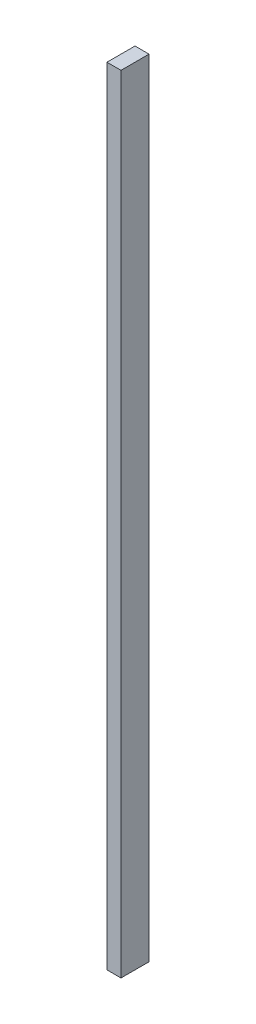
ISO-10303-21;
HEADER;
FILE_DESCRIPTION(('STEP AP214'),'2;1');
FILE_NAME('part.step','',(''),(''),'','','');
FILE_SCHEMA(('AUTOMOTIVE_DESIGN { 1 0 10303 214 1 1 1 1 }'));
ENDSEC;
DATA;
#1=APPLICATION_CONTEXT('core data for automotive mechanical design processes');
#2=APPLICATION_PROTOCOL_DEFINITION('international standard','automotive_design',2000,#1);
#3=PRODUCT_CONTEXT('',#1,'mechanical');
#4=PRODUCT('Part','Part','',(#3));
#5=PRODUCT_RELATED_PRODUCT_CATEGORY('part','',(#4));
#6=PRODUCT_DEFINITION_FORMATION('','',#4);
#7=PRODUCT_DEFINITION_CONTEXT('part definition',#1,'design');
#8=PRODUCT_DEFINITION('design','',#6,#7);
#9=PRODUCT_DEFINITION_SHAPE('','',#8);
#10=(LENGTH_UNIT() NAMED_UNIT(*) SI_UNIT(.MILLI.,.METRE.));
#11=(NAMED_UNIT(*) PLANE_ANGLE_UNIT() SI_UNIT($,.RADIAN.));
#12=(NAMED_UNIT(*) SI_UNIT($,.STERADIAN.) SOLID_ANGLE_UNIT());
#13=UNCERTAINTY_MEASURE_WITH_UNIT(LENGTH_MEASURE(1.E-05),#10,'distance_accuracy_value','');
#14=(GEOMETRIC_REPRESENTATION_CONTEXT(3) GLOBAL_UNCERTAINTY_ASSIGNED_CONTEXT((#13)) GLOBAL_UNIT_ASSIGNED_CONTEXT((#10,
#11,#12)) REPRESENTATION_CONTEXT('',''));
#15=CARTESIAN_POINT('',(0.,0.,0.));
#16=DIRECTION('',(0.,0.,1.));
#17=DIRECTION('',(1.,0.,0.));
#18=AXIS2_PLACEMENT_3D('',#15,#16,#17);
#19=CARTESIAN_POINT('',(0.,56.,-2.));
#20=DIRECTION('',(-1.,0.,0.));
#21=DIRECTION('',(0.,0.,1.));
#22=AXIS2_PLACEMENT_3D('',#19,#20,#21);
#23=PLANE('',#22);
#24=DIRECTION('',(0.,0.,-1.));
#25=VECTOR('',#24,1.);
#26=CARTESIAN_POINT('',(0.,0.,-2.));
#27=LINE('',#26,#25);
#28=CARTESIAN_POINT('',(0.,0.,0.));
#29=VERTEX_POINT('',#28);
#30=CARTESIAN_POINT('',(0.,0.,-2.));
#31=VERTEX_POINT('',#30);
#32=EDGE_CURVE('E97',#29,#31,#27,.T.);
#33=ORIENTED_EDGE('',*,*,#32,.F.);
#34=DIRECTION('',(0.,-1.,0.));
#35=VECTOR('',#34,1.);
#36=CARTESIAN_POINT('',(0.,56.,0.));
#37=LINE('',#36,#35);
#38=CARTESIAN_POINT('',(0.,56.,0.));
#39=VERTEX_POINT('',#38);
#40=EDGE_CURVE('E11',#39,#29,#37,.T.);
#41=ORIENTED_EDGE('',*,*,#40,.F.);
#42=DIRECTION('',(0.,0.,-1.));
#43=VECTOR('',#42,1.);
#44=CARTESIAN_POINT('',(0.,56.,-2.));
#45=LINE('',#44,#43);
#46=CARTESIAN_POINT('',(0.,56.,-2.));
#47=VERTEX_POINT('',#46);
#48=EDGE_CURVE('E91',#39,#47,#45,.T.);
#49=ORIENTED_EDGE('',*,*,#48,.T.);
#50=DIRECTION('',(0.,-1.,0.));
#51=VECTOR('',#50,1.);
#52=CARTESIAN_POINT('',(0.,56.,-2.));
#53=LINE('',#52,#51);
#54=EDGE_CURVE('E36',#47,#31,#53,.T.);
#55=ORIENTED_EDGE('',*,*,#54,.T.);
#56=EDGE_LOOP('',(#33,#41,#49,#55));
#57=FACE_BOUND('',#56,.T.);
#58=ADVANCED_FACE('F33',(#57),#23,.T.);
#59=CARTESIAN_POINT('',(0.,56.,0.));
#60=DIRECTION('',(0.,0.,1.));
#61=DIRECTION('',(1.,0.,0.));
#62=AXIS2_PLACEMENT_3D('',#59,#60,#61);
#63=PLANE('',#62);
#64=DIRECTION('',(-1.,0.,0.));
#65=VECTOR('',#64,1.);
#66=CARTESIAN_POINT('',(0.,0.,0.));
#67=LINE('',#66,#65);
#68=CARTESIAN_POINT('',(1.,0.,0.));
#69=VERTEX_POINT('',#68);
#70=EDGE_CURVE('E93',#69,#29,#67,.T.);
#71=ORIENTED_EDGE('',*,*,#70,.F.);
#72=DIRECTION('',(0.,-1.,0.));
#73=VECTOR('',#72,1.);
#74=CARTESIAN_POINT('',(1.,56.,0.));
#75=LINE('',#74,#73);
#76=CARTESIAN_POINT('',(1.,56.,0.));
#77=VERTEX_POINT('',#76);
#78=EDGE_CURVE('E42',#77,#69,#75,.T.);
#79=ORIENTED_EDGE('',*,*,#78,.F.);
#80=DIRECTION('',(-1.,0.,0.));
#81=VECTOR('',#80,1.);
#82=CARTESIAN_POINT('',(0.,56.,0.));
#83=LINE('',#82,#81);
#84=EDGE_CURVE('E88',#77,#39,#83,.T.);
#85=ORIENTED_EDGE('',*,*,#84,.T.);
#86=ORIENTED_EDGE('',*,*,#40,.T.);
#87=EDGE_LOOP('',(#71,#79,#85,#86));
#88=FACE_BOUND('',#87,.T.);
#89=ADVANCED_FACE('F107',(#88),#63,.T.);
#90=CARTESIAN_POINT('',(1.,56.,-2.));
#91=DIRECTION('',(1.,0.,0.));
#92=DIRECTION('',(0.,0.,-1.));
#93=AXIS2_PLACEMENT_3D('',#90,#91,#92);
#94=PLANE('',#93);
#95=DIRECTION('',(0.,0.,1.));
#96=VECTOR('',#95,1.);
#97=CARTESIAN_POINT('',(1.,0.,-2.));
#98=LINE('',#97,#96);
#99=CARTESIAN_POINT('',(1.,0.,-2.));
#100=VERTEX_POINT('',#99);
#101=EDGE_CURVE('E83',#100,#69,#98,.T.);
#102=ORIENTED_EDGE('',*,*,#101,.F.);
#103=DIRECTION('',(0.,-1.,0.));
#104=VECTOR('',#103,1.);
#105=CARTESIAN_POINT('',(1.,56.,-2.));
#106=LINE('',#105,#104);
#107=CARTESIAN_POINT('',(1.,56.,-2.));
#108=VERTEX_POINT('',#107);
#109=EDGE_CURVE('E78',#108,#100,#106,.T.);
#110=ORIENTED_EDGE('',*,*,#109,.F.);
#111=DIRECTION('',(0.,0.,1.));
#112=VECTOR('',#111,1.);
#113=CARTESIAN_POINT('',(1.,56.,-2.));
#114=LINE('',#113,#112);
#115=EDGE_CURVE('E81',#108,#77,#114,.T.);
#116=ORIENTED_EDGE('',*,*,#115,.T.);
#117=ORIENTED_EDGE('',*,*,#78,.T.);
#118=EDGE_LOOP('',(#102,#110,#116,#117));
#119=FACE_BOUND('',#118,.T.);
#120=ADVANCED_FACE('F80',(#119),#94,.T.);
#121=CARTESIAN_POINT('',(0.,56.,-2.));
#122=DIRECTION('',(0.,0.,-1.));
#123=DIRECTION('',(-1.,0.,0.));
#124=AXIS2_PLACEMENT_3D('',#121,#122,#123);
#125=PLANE('',#124);
#126=DIRECTION('',(1.,0.,0.));
#127=VECTOR('',#126,1.);
#128=CARTESIAN_POINT('',(0.,0.,-2.));
#129=LINE('',#128,#127);
#130=EDGE_CURVE('E100',#31,#100,#129,.T.);
#131=ORIENTED_EDGE('',*,*,#130,.F.);
#132=ORIENTED_EDGE('',*,*,#54,.F.);
#133=DIRECTION('',(1.,0.,0.));
#134=VECTOR('',#133,1.);
#135=CARTESIAN_POINT('',(0.,56.,-2.));
#136=LINE('',#135,#134);
#137=EDGE_CURVE('E87',#47,#108,#136,.T.);
#138=ORIENTED_EDGE('',*,*,#137,.T.);
#139=ORIENTED_EDGE('',*,*,#109,.T.);
#140=EDGE_LOOP('',(#131,#132,#138,#139));
#141=FACE_BOUND('',#140,.T.);
#142=ADVANCED_FACE('F90',(#141),#125,.T.);
#143=CARTESIAN_POINT('',(0.,56.,0.));
#144=DIRECTION('',(0.,1.,0.));
#145=DIRECTION('',(0.,0.,1.));
#146=AXIS2_PLACEMENT_3D('',#143,#144,#145);
#147=PLANE('',#146);
#148=ORIENTED_EDGE('',*,*,#48,.F.);
#149=ORIENTED_EDGE('',*,*,#84,.F.);
#150=ORIENTED_EDGE('',*,*,#115,.F.);
#151=ORIENTED_EDGE('',*,*,#137,.F.);
#152=EDGE_LOOP('',(#148,#149,#150,#151));
#153=FACE_BOUND('',#152,.T.);
#154=ADVANCED_FACE('F86',(#153),#147,.T.);
#155=CARTESIAN_POINT('',(0.,0.,0.));
#156=DIRECTION('',(0.,1.,0.));
#157=DIRECTION('',(0.,0.,1.));
#158=AXIS2_PLACEMENT_3D('',#155,#156,#157);
#159=PLANE('',#158);
#160=ORIENTED_EDGE('',*,*,#32,.T.);
#161=ORIENTED_EDGE('',*,*,#130,.T.);
#162=ORIENTED_EDGE('',*,*,#101,.T.);
#163=ORIENTED_EDGE('',*,*,#70,.T.);
#164=EDGE_LOOP('',(#160,#161,#162,#163));
#165=FACE_BOUND('',#164,.T.);
#166=ADVANCED_FACE('F106',(#165),#159,.F.);
#167=CLOSED_SHELL('',(#58,#89,#120,#142,#154,#166));
#168=MANIFOLD_SOLID_BREP('B2',#167);
#169=ADVANCED_BREP_SHAPE_REPRESENTATION('',(#18,#168),#14);
#170=SHAPE_DEFINITION_REPRESENTATION(#9,#169);
ENDSEC;
END-ISO-10303-21;
